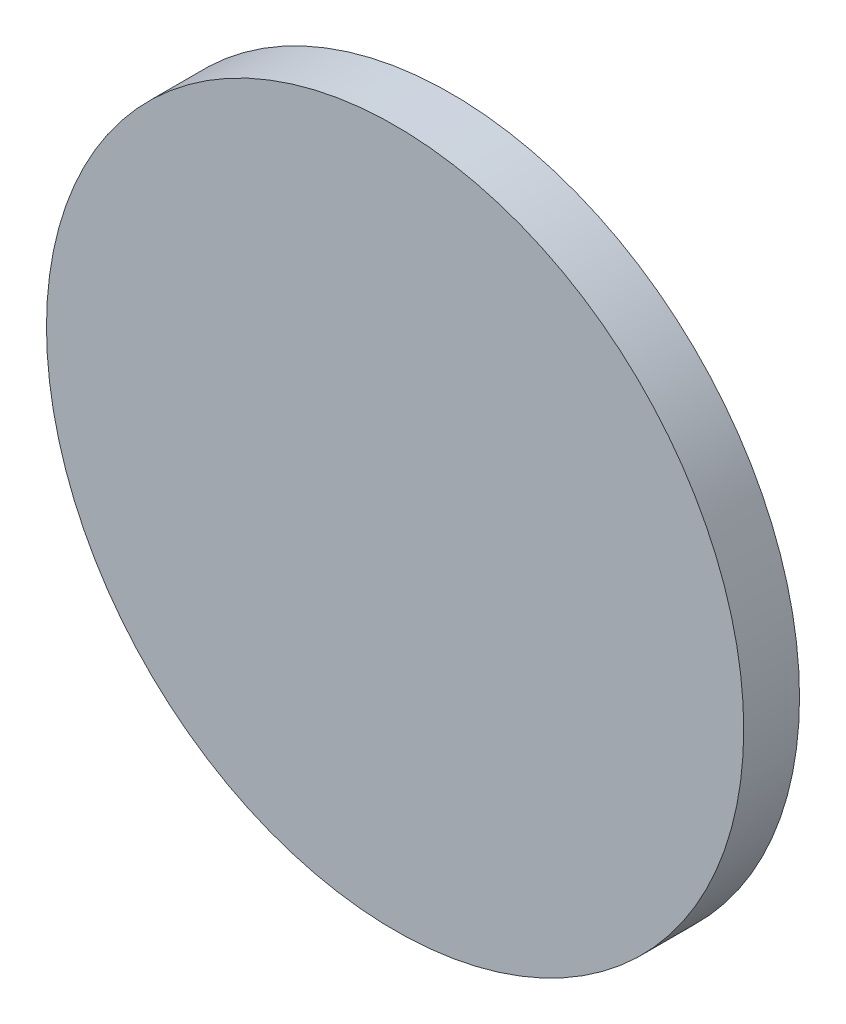
ISO-10303-21;
HEADER;
FILE_DESCRIPTION(('STEP AP214'),'2;1');
FILE_NAME('part.step','',(''),(''),'','','');
FILE_SCHEMA(('AUTOMOTIVE_DESIGN { 1 0 10303 214 1 1 1 1 }'));
ENDSEC;
DATA;
#1=APPLICATION_CONTEXT('core data for automotive mechanical design processes');
#2=APPLICATION_PROTOCOL_DEFINITION('international standard','automotive_design',2000,#1);
#3=PRODUCT_CONTEXT('',#1,'mechanical');
#4=PRODUCT('Part','Part','',(#3));
#5=PRODUCT_RELATED_PRODUCT_CATEGORY('part','',(#4));
#6=PRODUCT_DEFINITION_FORMATION('','',#4);
#7=PRODUCT_DEFINITION_CONTEXT('part definition',#1,'design');
#8=PRODUCT_DEFINITION('design','',#6,#7);
#9=PRODUCT_DEFINITION_SHAPE('','',#8);
#10=(LENGTH_UNIT() NAMED_UNIT(*) SI_UNIT(.MILLI.,.METRE.));
#11=(NAMED_UNIT(*) PLANE_ANGLE_UNIT() SI_UNIT($,.RADIAN.));
#12=(NAMED_UNIT(*) SI_UNIT($,.STERADIAN.) SOLID_ANGLE_UNIT());
#13=UNCERTAINTY_MEASURE_WITH_UNIT(LENGTH_MEASURE(1.E-05),#10,'distance_accuracy_value','');
#14=(GEOMETRIC_REPRESENTATION_CONTEXT(3) GLOBAL_UNCERTAINTY_ASSIGNED_CONTEXT((#13)) GLOBAL_UNIT_ASSIGNED_CONTEXT((#10,
#11,#12)) REPRESENTATION_CONTEXT('',''));
#15=CARTESIAN_POINT('',(0.,0.,0.));
#16=DIRECTION('',(0.,0.,1.));
#17=DIRECTION('',(1.,0.,0.));
#18=AXIS2_PLACEMENT_3D('',#15,#16,#17);
#19=CARTESIAN_POINT('',(0.,0.,1.));
#20=DIRECTION('',(0.,0.,-1.));
#21=DIRECTION('',(-1.,0.,0.));
#22=AXIS2_PLACEMENT_3D('',#19,#20,#21);
#23=CYLINDRICAL_SURFACE('',#22,6.25);
#24=CARTESIAN_POINT('',(0.,0.,1.));
#25=DIRECTION('',(0.,0.,1.));
#26=DIRECTION('',(1.,0.,0.));
#27=AXIS2_PLACEMENT_3D('',#24,#25,#26);
#28=CIRCLE('',#27,6.25);
#29=CARTESIAN_POINT('',(6.25,0.,1.));
#30=VERTEX_POINT('',#29);
#31=EDGE_CURVE('E10',#30,#30,#28,.T.);
#32=ORIENTED_EDGE('',*,*,#31,.F.);
#33=EDGE_LOOP('',(#32));
#34=FACE_BOUND('',#33,.T.);
#35=CARTESIAN_POINT('',(0.,0.,0.));
#36=DIRECTION('',(0.,0.,1.));
#37=DIRECTION('',(1.,0.,0.));
#38=AXIS2_PLACEMENT_3D('',#35,#36,#37);
#39=CIRCLE('',#38,6.25);
#40=CARTESIAN_POINT('',(6.25,0.,0.));
#41=VERTEX_POINT('',#40);
#42=EDGE_CURVE('E38',#41,#41,#39,.T.);
#43=ORIENTED_EDGE('',*,*,#42,.T.);
#44=EDGE_LOOP('',(#43));
#45=FACE_BOUND('',#44,.T.);
#46=ADVANCED_FACE('F35',(#34,#45),#23,.T.);
#47=CARTESIAN_POINT('',(0.,0.,1.));
#48=DIRECTION('',(0.,0.,1.));
#49=DIRECTION('',(1.,0.,0.));
#50=AXIS2_PLACEMENT_3D('',#47,#48,#49);
#51=PLANE('',#50);
#52=ORIENTED_EDGE('',*,*,#31,.T.);
#53=EDGE_LOOP('',(#52));
#54=FACE_BOUND('',#53,.T.);
#55=ADVANCED_FACE('F50',(#54),#51,.T.);
#56=CARTESIAN_POINT('',(0.,0.,0.));
#57=DIRECTION('',(0.,0.,1.));
#58=DIRECTION('',(1.,0.,0.));
#59=AXIS2_PLACEMENT_3D('',#56,#57,#58);
#60=PLANE('',#59);
#61=ORIENTED_EDGE('',*,*,#42,.F.);
#62=EDGE_LOOP('',(#61));
#63=FACE_BOUND('',#62,.T.);
#64=ADVANCED_FACE('F48',(#63),#60,.F.);
#65=CLOSED_SHELL('',(#46,#55,#64));
#66=MANIFOLD_SOLID_BREP('B2',#65);
#67=ADVANCED_BREP_SHAPE_REPRESENTATION('',(#18,#66),#14);
#68=SHAPE_DEFINITION_REPRESENTATION(#9,#67);
ENDSEC;
END-ISO-10303-21;
